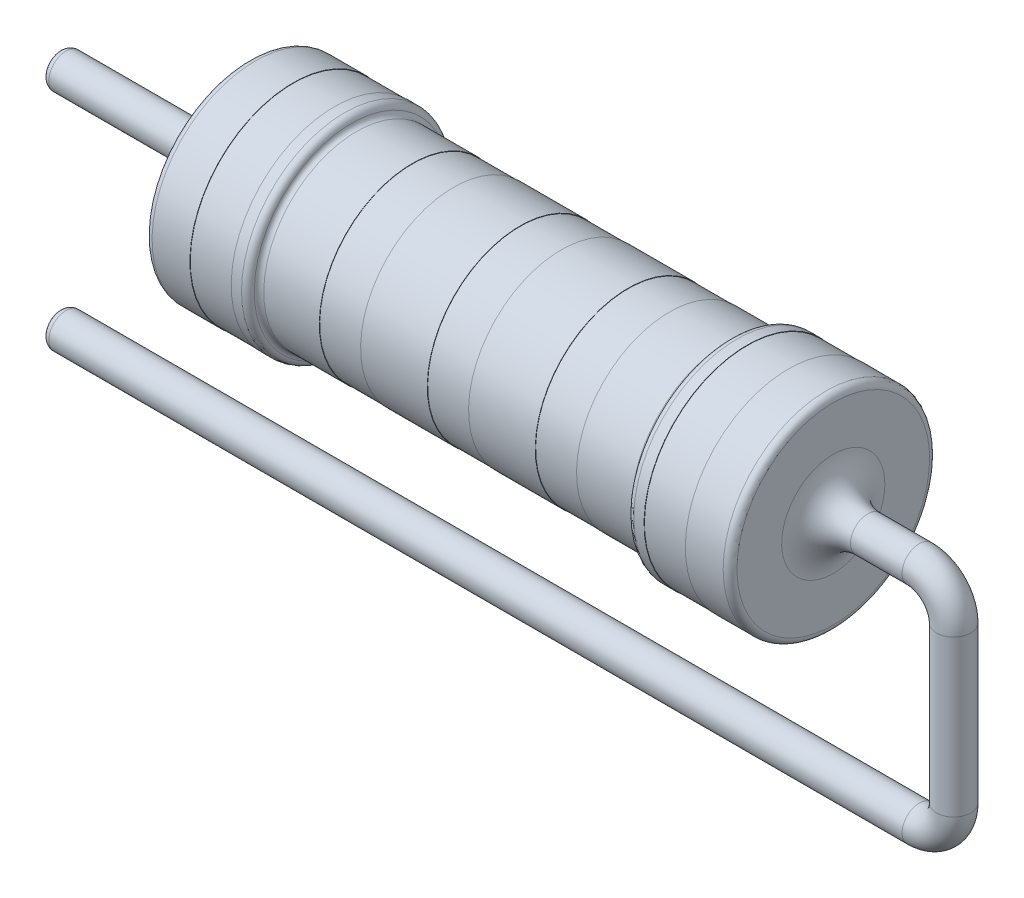
ISO-10303-21;
HEADER;
FILE_DESCRIPTION(('STEP AP214'),'2;1');
FILE_NAME('part.step','',(''),(''),'','','');
FILE_SCHEMA(('AUTOMOTIVE_DESIGN { 1 0 10303 214 1 1 1 1 }'));
ENDSEC;
DATA;
#1=APPLICATION_CONTEXT('core data for automotive mechanical design processes');
#2=APPLICATION_PROTOCOL_DEFINITION('international standard','automotive_design',2000,#1);
#3=PRODUCT_CONTEXT('',#1,'mechanical');
#4=PRODUCT('Part','Part','',(#3));
#5=PRODUCT_RELATED_PRODUCT_CATEGORY('part','',(#4));
#6=PRODUCT_DEFINITION_FORMATION('','',#4);
#7=PRODUCT_DEFINITION_CONTEXT('part definition',#1,'design');
#8=PRODUCT_DEFINITION('design','',#6,#7);
#9=PRODUCT_DEFINITION_SHAPE('','',#8);
#10=(LENGTH_UNIT() NAMED_UNIT(*) SI_UNIT(.MILLI.,.METRE.));
#11=(NAMED_UNIT(*) PLANE_ANGLE_UNIT() SI_UNIT($,.RADIAN.));
#12=(NAMED_UNIT(*) SI_UNIT($,.STERADIAN.) SOLID_ANGLE_UNIT());
#13=UNCERTAINTY_MEASURE_WITH_UNIT(LENGTH_MEASURE(1.E-05),#10,'distance_accuracy_value','');
#14=(GEOMETRIC_REPRESENTATION_CONTEXT(3) GLOBAL_UNCERTAINTY_ASSIGNED_CONTEXT((#13)) GLOBAL_UNIT_ASSIGNED_CONTEXT((#10,
#11,#12)) REPRESENTATION_CONTEXT('',''));
#15=CARTESIAN_POINT('',(0.,0.,0.));
#16=DIRECTION('',(0.,0.,1.));
#17=DIRECTION('',(1.,0.,0.));
#18=AXIS2_PLACEMENT_3D('',#15,#16,#17);
#19=CARTESIAN_POINT('',(8.5,0.,0.));
#20=DIRECTION('',(1.,0.,0.));
#21=DIRECTION('',(0.,1.,0.));
#22=AXIS2_PLACEMENT_3D('',#19,#20,#21);
#23=PLANE('',#22);
#24=CARTESIAN_POINT('',(8.5,0.,0.));
#25=DIRECTION('',(1.,0.,0.));
#26=DIRECTION('',(0.,1.,0.));
#27=AXIS2_PLACEMENT_3D('',#24,#25,#26);
#28=CIRCLE('',#27,1.5);
#29=CARTESIAN_POINT('',(8.5,1.5,0.));
#30=VERTEX_POINT('',#29);
#31=EDGE_CURVE('E45',#30,#30,#28,.F.);
#32=ORIENTED_EDGE('',*,*,#31,.T.);
#33=EDGE_LOOP('',(#32));
#34=FACE_BOUND('',#33,.T.);
#35=CARTESIAN_POINT('',(8.5,0.,0.));
#36=DIRECTION('',(1.,0.,0.));
#37=DIRECTION('',(0.,1.,0.));
#38=AXIS2_PLACEMENT_3D('',#35,#36,#37);
#39=CIRCLE('',#38,2.8);
#40=CARTESIAN_POINT('',(8.5,2.8,0.));
#41=VERTEX_POINT('',#40);
#42=EDGE_CURVE('E87',#41,#41,#39,.T.);
#43=ORIENTED_EDGE('',*,*,#42,.T.);
#44=EDGE_LOOP('',(#43));
#45=FACE_BOUND('',#44,.T.);
#46=ADVANCED_FACE('F34',(#34,#45),#23,.T.);
#47=CARTESIAN_POINT('',(-8.5,0.,0.));
#48=DIRECTION('',(-1.,0.,0.));
#49=DIRECTION('',(0.,-1.,0.));
#50=AXIS2_PLACEMENT_3D('',#47,#48,#49);
#51=CYLINDRICAL_SURFACE('',#50,3.);
#52=CARTESIAN_POINT('',(8.3,0.,0.));
#53=DIRECTION('',(1.,0.,0.));
#54=DIRECTION('',(0.,1.,0.));
#55=AXIS2_PLACEMENT_3D('',#52,#53,#54);
#56=CIRCLE('',#55,3.);
#57=CARTESIAN_POINT('',(8.3,3.,0.));
#58=VERTEX_POINT('',#57);
#59=EDGE_CURVE('E90',#58,#58,#56,.F.);
#60=ORIENTED_EDGE('',*,*,#59,.T.);
#61=EDGE_LOOP('',(#60));
#62=FACE_BOUND('',#61,.T.);
#63=CARTESIAN_POINT('',(7.2,0.,0.));
#64=DIRECTION('',(-1.,0.,0.));
#65=DIRECTION('',(0.,-1.,0.));
#66=AXIS2_PLACEMENT_3D('',#63,#64,#65);
#67=CIRCLE('',#66,3.);
#68=CARTESIAN_POINT('',(7.2,-3.,0.));
#69=VERTEX_POINT('',#68);
#70=EDGE_CURVE('E96',#69,#69,#67,.T.);
#71=ORIENTED_EDGE('',*,*,#70,.F.);
#72=EDGE_LOOP('',(#71));
#73=FACE_BOUND('',#72,.T.);
#74=ADVANCED_FACE('F187',(#62,#73),#51,.T.);
#75=CARTESIAN_POINT('',(7.2,-3.,0.));
#76=DIRECTION('',(-1.,0.,0.));
#77=DIRECTION('',(0.,-1.,0.));
#78=AXIS2_PLACEMENT_3D('',#75,#76,#77);
#79=PLANE('',#78);
#80=ORIENTED_EDGE('',*,*,#70,.T.);
#81=EDGE_LOOP('',(#80));
#82=FACE_BOUND('',#81,.T.);
#83=CARTESIAN_POINT('',(7.2,0.,0.));
#84=DIRECTION('',(-1.,0.,0.));
#85=DIRECTION('',(0.,-1.,0.));
#86=AXIS2_PLACEMENT_3D('',#83,#84,#85);
#87=CIRCLE('',#86,2.99);
#88=CARTESIAN_POINT('',(7.2,-2.99,0.));
#89=VERTEX_POINT('',#88);
#90=EDGE_CURVE('E99',#89,#89,#87,.T.);
#91=ORIENTED_EDGE('',*,*,#90,.F.);
#92=EDGE_LOOP('',(#91));
#93=FACE_BOUND('',#92,.T.);
#94=ADVANCED_FACE('F193',(#82,#93),#79,.T.);
#95=CARTESIAN_POINT('',(-8.5,0.,0.));
#96=DIRECTION('',(-1.,0.,0.));
#97=DIRECTION('',(0.,-1.,0.));
#98=AXIS2_PLACEMENT_3D('',#95,#96,#97);
#99=CYLINDRICAL_SURFACE('',#98,2.99);
#100=ORIENTED_EDGE('',*,*,#90,.T.);
#101=EDGE_LOOP('',(#100));
#102=FACE_BOUND('',#101,.T.);
#103=CARTESIAN_POINT('',(6.,0.,0.));
#104=DIRECTION('',(-1.,0.,0.));
#105=DIRECTION('',(0.,-1.,0.));
#106=AXIS2_PLACEMENT_3D('',#103,#104,#105);
#107=CIRCLE('',#106,2.99);
#108=CARTESIAN_POINT('',(6.,-2.99,0.));
#109=VERTEX_POINT('',#108);
#110=EDGE_CURVE('E102',#109,#109,#107,.T.);
#111=ORIENTED_EDGE('',*,*,#110,.F.);
#112=EDGE_LOOP('',(#111));
#113=FACE_BOUND('',#112,.T.);
#114=ADVANCED_FACE('F596',(#102,#113),#99,.T.);
#115=CARTESIAN_POINT('',(6.,-2.99,0.));
#116=DIRECTION('',(1.,0.,0.));
#117=DIRECTION('',(0.,1.,0.));
#118=AXIS2_PLACEMENT_3D('',#115,#116,#117);
#119=PLANE('',#118);
#120=ORIENTED_EDGE('',*,*,#110,.T.);
#121=EDGE_LOOP('',(#120));
#122=FACE_BOUND('',#121,.T.);
#123=CARTESIAN_POINT('',(6.,0.,0.));
#124=DIRECTION('',(-1.,0.,0.));
#125=DIRECTION('',(0.,-1.,0.));
#126=AXIS2_PLACEMENT_3D('',#123,#124,#125);
#127=CIRCLE('',#126,3.);
#128=CARTESIAN_POINT('',(6.,-3.,0.));
#129=VERTEX_POINT('',#128);
#130=EDGE_CURVE('E105',#129,#129,#127,.T.);
#131=ORIENTED_EDGE('',*,*,#130,.F.);
#132=EDGE_LOOP('',(#131));
#133=FACE_BOUND('',#132,.T.);
#134=ADVANCED_FACE('F446',(#122,#133),#119,.T.);
#135=CARTESIAN_POINT('',(-8.5,0.,0.));
#136=DIRECTION('',(-1.,0.,0.));
#137=DIRECTION('',(0.,-1.,0.));
#138=AXIS2_PLACEMENT_3D('',#135,#136,#137);
#139=CYLINDRICAL_SURFACE('',#138,3.);
#140=CARTESIAN_POINT('',(5.7,0.,0.));
#141=DIRECTION('',(-1.,0.,0.));
#142=DIRECTION('',(0.,-1.,0.));
#143=AXIS2_PLACEMENT_3D('',#140,#141,#142);
#144=CIRCLE('',#143,3.);
#145=CARTESIAN_POINT('',(5.7,-3.,0.));
#146=VERTEX_POINT('',#145);
#147=EDGE_CURVE('E93',#146,#146,#144,.F.);
#148=ORIENTED_EDGE('',*,*,#147,.T.);
#149=EDGE_LOOP('',(#148));
#150=FACE_BOUND('',#149,.T.);
#151=ORIENTED_EDGE('',*,*,#130,.T.);
#152=EDGE_LOOP('',(#151));
#153=FACE_BOUND('',#152,.T.);
#154=ADVANCED_FACE('F404',(#150,#153),#139,.T.);
#155=CARTESIAN_POINT('',(-8.5,0.,0.));
#156=DIRECTION('',(-1.,0.,0.));
#157=DIRECTION('',(0.,-1.,0.));
#158=AXIS2_PLACEMENT_3D('',#155,#156,#157);
#159=CYLINDRICAL_SURFACE('',#158,2.7);
#160=CARTESIAN_POINT('',(5.35358983848622,0.,0.));
#161=DIRECTION('',(-1.,0.,0.));
#162=DIRECTION('',(0.,-1.,0.));
#163=AXIS2_PLACEMENT_3D('',#160,#161,#162);
#164=CIRCLE('',#163,2.7);
#165=CARTESIAN_POINT('',(5.35358983848622,-2.7,0.));
#166=VERTEX_POINT('',#165);
#167=EDGE_CURVE('E69',#166,#166,#164,.T.);
#168=ORIENTED_EDGE('',*,*,#167,.T.);
#169=EDGE_LOOP('',(#168));
#170=FACE_BOUND('',#169,.T.);
#171=CARTESIAN_POINT('',(3.73802223615149,0.,0.));
#172=DIRECTION('',(-1.,0.,0.));
#173=DIRECTION('',(0.,-1.,0.));
#174=AXIS2_PLACEMENT_3D('',#171,#172,#173);
#175=CIRCLE('',#174,2.7);
#176=CARTESIAN_POINT('',(3.73802223615149,-2.7,0.));
#177=VERTEX_POINT('',#176);
#178=EDGE_CURVE('E108',#177,#177,#175,.T.);
#179=ORIENTED_EDGE('',*,*,#178,.F.);
#180=EDGE_LOOP('',(#179));
#181=FACE_BOUND('',#180,.T.);
#182=ADVANCED_FACE('F398',(#170,#181),#159,.T.);
#183=CARTESIAN_POINT('',(3.73802223615149,-2.7,0.));
#184=DIRECTION('',(-1.,0.,0.));
#185=DIRECTION('',(0.,-1.,0.));
#186=AXIS2_PLACEMENT_3D('',#183,#184,#185);
#187=PLANE('',#186);
#188=ORIENTED_EDGE('',*,*,#178,.T.);
#189=EDGE_LOOP('',(#188));
#190=FACE_BOUND('',#189,.T.);
#191=CARTESIAN_POINT('',(3.73802223615149,0.,0.));
#192=DIRECTION('',(-1.,0.,0.));
#193=DIRECTION('',(0.,-1.,0.));
#194=AXIS2_PLACEMENT_3D('',#191,#192,#193);
#195=CIRCLE('',#194,2.69);
#196=CARTESIAN_POINT('',(3.73802223615149,-2.69,0.));
#197=VERTEX_POINT('',#196);
#198=EDGE_CURVE('E111',#197,#197,#195,.T.);
#199=ORIENTED_EDGE('',*,*,#198,.F.);
#200=EDGE_LOOP('',(#199));
#201=FACE_BOUND('',#200,.T.);
#202=ADVANCED_FACE('F403',(#190,#201),#187,.T.);
#203=CARTESIAN_POINT('',(-8.5,0.,0.));
#204=DIRECTION('',(-1.,0.,0.));
#205=DIRECTION('',(0.,-1.,0.));
#206=AXIS2_PLACEMENT_3D('',#203,#204,#205);
#207=CYLINDRICAL_SURFACE('',#206,2.69);
#208=ORIENTED_EDGE('',*,*,#198,.T.);
#209=EDGE_LOOP('',(#208));
#210=FACE_BOUND('',#209,.T.);
#211=CARTESIAN_POINT('',(2.53802223615149,0.,0.));
#212=DIRECTION('',(-1.,0.,0.));
#213=DIRECTION('',(0.,-1.,0.));
#214=AXIS2_PLACEMENT_3D('',#211,#212,#213);
#215=CIRCLE('',#214,2.69);
#216=CARTESIAN_POINT('',(2.53802223615149,-2.69,0.));
#217=VERTEX_POINT('',#216);
#218=EDGE_CURVE('E114',#217,#217,#215,.T.);
#219=ORIENTED_EDGE('',*,*,#218,.F.);
#220=EDGE_LOOP('',(#219));
#221=FACE_BOUND('',#220,.T.);
#222=ADVANCED_FACE('F571',(#210,#221),#207,.T.);
#223=CARTESIAN_POINT('',(2.53802223615149,-2.69,0.));
#224=DIRECTION('',(1.,0.,0.));
#225=DIRECTION('',(0.,1.,0.));
#226=AXIS2_PLACEMENT_3D('',#223,#224,#225);
#227=PLANE('',#226);
#228=ORIENTED_EDGE('',*,*,#218,.T.);
#229=EDGE_LOOP('',(#228));
#230=FACE_BOUND('',#229,.T.);
#231=CARTESIAN_POINT('',(2.53802223615149,0.,0.));
#232=DIRECTION('',(-1.,0.,0.));
#233=DIRECTION('',(0.,-1.,0.));
#234=AXIS2_PLACEMENT_3D('',#231,#232,#233);
#235=CIRCLE('',#234,2.7);
#236=CARTESIAN_POINT('',(2.53802223615149,-2.7,0.));
#237=VERTEX_POINT('',#236);
#238=EDGE_CURVE('E117',#237,#237,#235,.T.);
#239=ORIENTED_EDGE('',*,*,#238,.F.);
#240=EDGE_LOOP('',(#239));
#241=FACE_BOUND('',#240,.T.);
#242=ADVANCED_FACE('F561',(#230,#241),#227,.T.);
#243=CARTESIAN_POINT('',(-8.5,0.,0.));
#244=DIRECTION('',(-1.,0.,0.));
#245=DIRECTION('',(0.,-1.,0.));
#246=AXIS2_PLACEMENT_3D('',#243,#244,#245);
#247=CYLINDRICAL_SURFACE('',#246,2.7);
#248=ORIENTED_EDGE('',*,*,#238,.T.);
#249=EDGE_LOOP('',(#248));
#250=FACE_BOUND('',#249,.T.);
#251=CARTESIAN_POINT('',(0.6,0.,0.));
#252=DIRECTION('',(-1.,0.,0.));
#253=DIRECTION('',(0.,-1.,0.));
#254=AXIS2_PLACEMENT_3D('',#251,#252,#253);
#255=CIRCLE('',#254,2.7);
#256=CARTESIAN_POINT('',(0.6,-2.7,0.));
#257=VERTEX_POINT('',#256);
#258=EDGE_CURVE('E120',#257,#257,#255,.T.);
#259=ORIENTED_EDGE('',*,*,#258,.F.);
#260=EDGE_LOOP('',(#259));
#261=FACE_BOUND('',#260,.T.);
#262=ADVANCED_FACE('F551',(#250,#261),#247,.T.);
#263=CARTESIAN_POINT('',(0.6,-2.7,0.));
#264=DIRECTION('',(-1.,0.,0.));
#265=DIRECTION('',(0.,-1.,0.));
#266=AXIS2_PLACEMENT_3D('',#263,#264,#265);
#267=PLANE('',#266);
#268=ORIENTED_EDGE('',*,*,#258,.T.);
#269=EDGE_LOOP('',(#268));
#270=FACE_BOUND('',#269,.T.);
#271=CARTESIAN_POINT('',(0.6,0.,0.));
#272=DIRECTION('',(-1.,0.,0.));
#273=DIRECTION('',(0.,-1.,0.));
#274=AXIS2_PLACEMENT_3D('',#271,#272,#273);
#275=CIRCLE('',#274,2.69);
#276=CARTESIAN_POINT('',(0.6,-2.69,0.));
#277=VERTEX_POINT('',#276);
#278=EDGE_CURVE('E123',#277,#277,#275,.T.);
#279=ORIENTED_EDGE('',*,*,#278,.F.);
#280=EDGE_LOOP('',(#279));
#281=FACE_BOUND('',#280,.T.);
#282=ADVANCED_FACE('F540',(#270,#281),#267,.T.);
#283=CARTESIAN_POINT('',(-8.5,0.,0.));
#284=DIRECTION('',(-1.,0.,0.));
#285=DIRECTION('',(0.,-1.,0.));
#286=AXIS2_PLACEMENT_3D('',#283,#284,#285);
#287=CYLINDRICAL_SURFACE('',#286,2.69);
#288=ORIENTED_EDGE('',*,*,#278,.T.);
#289=EDGE_LOOP('',(#288));
#290=FACE_BOUND('',#289,.T.);
#291=CARTESIAN_POINT('',(-0.6,0.,0.));
#292=DIRECTION('',(-1.,0.,0.));
#293=DIRECTION('',(0.,-1.,0.));
#294=AXIS2_PLACEMENT_3D('',#291,#292,#293);
#295=CIRCLE('',#294,2.69);
#296=CARTESIAN_POINT('',(-0.6,-2.69,0.));
#297=VERTEX_POINT('',#296);
#298=EDGE_CURVE('E126',#297,#297,#295,.T.);
#299=ORIENTED_EDGE('',*,*,#298,.F.);
#300=EDGE_LOOP('',(#299));
#301=FACE_BOUND('',#300,.T.);
#302=ADVANCED_FACE('F530',(#290,#301),#287,.T.);
#303=CARTESIAN_POINT('',(-0.6,-2.7,0.));
#304=DIRECTION('',(1.,0.,0.));
#305=DIRECTION('',(0.,1.,0.));
#306=AXIS2_PLACEMENT_3D('',#303,#304,#305);
#307=PLANE('',#306);
#308=ORIENTED_EDGE('',*,*,#298,.T.);
#309=EDGE_LOOP('',(#308));
#310=FACE_BOUND('',#309,.T.);
#311=CARTESIAN_POINT('',(-0.6,0.,0.));
#312=DIRECTION('',(-1.,0.,0.));
#313=DIRECTION('',(0.,-1.,0.));
#314=AXIS2_PLACEMENT_3D('',#311,#312,#313);
#315=CIRCLE('',#314,2.7);
#316=CARTESIAN_POINT('',(-0.6,-2.7,0.));
#317=VERTEX_POINT('',#316);
#318=EDGE_CURVE('E129',#317,#317,#315,.T.);
#319=ORIENTED_EDGE('',*,*,#318,.F.);
#320=EDGE_LOOP('',(#319));
#321=FACE_BOUND('',#320,.T.);
#322=ADVANCED_FACE('F520',(#310,#321),#307,.T.);
#323=CARTESIAN_POINT('',(-8.5,0.,0.));
#324=DIRECTION('',(-1.,0.,0.));
#325=DIRECTION('',(0.,-1.,0.));
#326=AXIS2_PLACEMENT_3D('',#323,#324,#325);
#327=CYLINDRICAL_SURFACE('',#326,2.7);
#328=ORIENTED_EDGE('',*,*,#318,.T.);
#329=EDGE_LOOP('',(#328));
#330=FACE_BOUND('',#329,.T.);
#331=CARTESIAN_POINT('',(-2.53802223615149,0.,0.));
#332=DIRECTION('',(-1.,0.,0.));
#333=DIRECTION('',(0.,-1.,0.));
#334=AXIS2_PLACEMENT_3D('',#331,#332,#333);
#335=CIRCLE('',#334,2.7);
#336=CARTESIAN_POINT('',(-2.53802223615149,-2.7,0.));
#337=VERTEX_POINT('',#336);
#338=EDGE_CURVE('E132',#337,#337,#335,.T.);
#339=ORIENTED_EDGE('',*,*,#338,.F.);
#340=EDGE_LOOP('',(#339));
#341=FACE_BOUND('',#340,.T.);
#342=ADVANCED_FACE('F510',(#330,#341),#327,.T.);
#343=CARTESIAN_POINT('',(-2.53802223615149,-2.69,0.));
#344=DIRECTION('',(-1.,0.,0.));
#345=DIRECTION('',(0.,-1.,0.));
#346=AXIS2_PLACEMENT_3D('',#343,#344,#345);
#347=PLANE('',#346);
#348=ORIENTED_EDGE('',*,*,#338,.T.);
#349=EDGE_LOOP('',(#348));
#350=FACE_BOUND('',#349,.T.);
#351=CARTESIAN_POINT('',(-2.53802223615149,0.,0.));
#352=DIRECTION('',(-1.,0.,0.));
#353=DIRECTION('',(0.,-1.,0.));
#354=AXIS2_PLACEMENT_3D('',#351,#352,#353);
#355=CIRCLE('',#354,2.69);
#356=CARTESIAN_POINT('',(-2.53802223615149,-2.69,0.));
#357=VERTEX_POINT('',#356);
#358=EDGE_CURVE('E135',#357,#357,#355,.T.);
#359=ORIENTED_EDGE('',*,*,#358,.F.);
#360=EDGE_LOOP('',(#359));
#361=FACE_BOUND('',#360,.T.);
#362=ADVANCED_FACE('F499',(#350,#361),#347,.T.);
#363=CARTESIAN_POINT('',(-8.5,0.,0.));
#364=DIRECTION('',(-1.,0.,0.));
#365=DIRECTION('',(0.,-1.,0.));
#366=AXIS2_PLACEMENT_3D('',#363,#364,#365);
#367=CYLINDRICAL_SURFACE('',#366,2.69);
#368=ORIENTED_EDGE('',*,*,#358,.T.);
#369=EDGE_LOOP('',(#368));
#370=FACE_BOUND('',#369,.T.);
#371=CARTESIAN_POINT('',(-3.73802223615149,0.,0.));
#372=DIRECTION('',(-1.,0.,0.));
#373=DIRECTION('',(0.,-1.,0.));
#374=AXIS2_PLACEMENT_3D('',#371,#372,#373);
#375=CIRCLE('',#374,2.69);
#376=CARTESIAN_POINT('',(-3.73802223615149,-2.69,0.));
#377=VERTEX_POINT('',#376);
#378=EDGE_CURVE('E138',#377,#377,#375,.T.);
#379=ORIENTED_EDGE('',*,*,#378,.F.);
#380=EDGE_LOOP('',(#379));
#381=FACE_BOUND('',#380,.T.);
#382=ADVANCED_FACE('F489',(#370,#381),#367,.T.);
#383=CARTESIAN_POINT('',(-3.73802223615149,-2.7,0.));
#384=DIRECTION('',(1.,0.,0.));
#385=DIRECTION('',(0.,1.,0.));
#386=AXIS2_PLACEMENT_3D('',#383,#384,#385);
#387=PLANE('',#386);
#388=ORIENTED_EDGE('',*,*,#378,.T.);
#389=EDGE_LOOP('',(#388));
#390=FACE_BOUND('',#389,.T.);
#391=CARTESIAN_POINT('',(-3.73802223615149,0.,0.));
#392=DIRECTION('',(-1.,0.,0.));
#393=DIRECTION('',(0.,-1.,0.));
#394=AXIS2_PLACEMENT_3D('',#391,#392,#393);
#395=CIRCLE('',#394,2.7);
#396=CARTESIAN_POINT('',(-3.73802223615149,-2.7,0.));
#397=VERTEX_POINT('',#396);
#398=EDGE_CURVE('E141',#397,#397,#395,.T.);
#399=ORIENTED_EDGE('',*,*,#398,.F.);
#400=EDGE_LOOP('',(#399));
#401=FACE_BOUND('',#400,.T.);
#402=ADVANCED_FACE('F388',(#390,#401),#387,.T.);
#403=CARTESIAN_POINT('',(-8.5,0.,0.));
#404=DIRECTION('',(-1.,0.,0.));
#405=DIRECTION('',(0.,-1.,0.));
#406=AXIS2_PLACEMENT_3D('',#403,#404,#405);
#407=CYLINDRICAL_SURFACE('',#406,2.7);
#408=CARTESIAN_POINT('',(-5.35358983848623,0.,0.));
#409=DIRECTION('',(-1.,0.,0.));
#410=DIRECTION('',(0.,-1.,0.));
#411=AXIS2_PLACEMENT_3D('',#408,#409,#410);
#412=CIRCLE('',#411,2.7);
#413=CARTESIAN_POINT('',(-5.35358983848623,-2.7,0.));
#414=VERTEX_POINT('',#413);
#415=EDGE_CURVE('E72',#414,#414,#412,.F.);
#416=ORIENTED_EDGE('',*,*,#415,.T.);
#417=EDGE_LOOP('',(#416));
#418=FACE_BOUND('',#417,.T.);
#419=ORIENTED_EDGE('',*,*,#398,.T.);
#420=EDGE_LOOP('',(#419));
#421=FACE_BOUND('',#420,.T.);
#422=ADVANCED_FACE('F382',(#418,#421),#407,.T.);
#423=CARTESIAN_POINT('',(-8.5,0.,0.));
#424=DIRECTION('',(-1.,0.,0.));
#425=DIRECTION('',(0.,-1.,0.));
#426=AXIS2_PLACEMENT_3D('',#423,#424,#425);
#427=CYLINDRICAL_SURFACE('',#426,3.);
#428=CARTESIAN_POINT('',(-5.7,0.,0.));
#429=DIRECTION('',(1.,0.,0.));
#430=DIRECTION('',(0.,1.,0.));
#431=AXIS2_PLACEMENT_3D('',#428,#429,#430);
#432=CIRCLE('',#431,3.);
#433=CARTESIAN_POINT('',(-5.7,3.,0.));
#434=VERTEX_POINT('',#433);
#435=EDGE_CURVE('E84',#434,#434,#432,.F.);
#436=ORIENTED_EDGE('',*,*,#435,.T.);
#437=EDGE_LOOP('',(#436));
#438=FACE_BOUND('',#437,.T.);
#439=CARTESIAN_POINT('',(-6.,0.,0.));
#440=DIRECTION('',(-1.,0.,0.));
#441=DIRECTION('',(0.,-1.,0.));
#442=AXIS2_PLACEMENT_3D('',#439,#440,#441);
#443=CIRCLE('',#442,3.);
#444=CARTESIAN_POINT('',(-6.,-3.,0.));
#445=VERTEX_POINT('',#444);
#446=EDGE_CURVE('E144',#445,#445,#443,.T.);
#447=ORIENTED_EDGE('',*,*,#446,.F.);
#448=EDGE_LOOP('',(#447));
#449=FACE_BOUND('',#448,.T.);
#450=ADVANCED_FACE('F387',(#438,#449),#427,.T.);
#451=CARTESIAN_POINT('',(-6.,-2.99,0.));
#452=DIRECTION('',(-1.,0.,0.));
#453=DIRECTION('',(0.,-1.,0.));
#454=AXIS2_PLACEMENT_3D('',#451,#452,#453);
#455=PLANE('',#454);
#456=ORIENTED_EDGE('',*,*,#446,.T.);
#457=EDGE_LOOP('',(#456));
#458=FACE_BOUND('',#457,.T.);
#459=CARTESIAN_POINT('',(-6.,0.,0.));
#460=DIRECTION('',(-1.,0.,0.));
#461=DIRECTION('',(0.,-1.,0.));
#462=AXIS2_PLACEMENT_3D('',#459,#460,#461);
#463=CIRCLE('',#462,2.99);
#464=CARTESIAN_POINT('',(-6.,-2.99,0.));
#465=VERTEX_POINT('',#464);
#466=EDGE_CURVE('E147',#465,#465,#463,.T.);
#467=ORIENTED_EDGE('',*,*,#466,.F.);
#468=EDGE_LOOP('',(#467));
#469=FACE_BOUND('',#468,.T.);
#470=ADVANCED_FACE('F436',(#458,#469),#455,.T.);
#471=CARTESIAN_POINT('',(-8.5,0.,0.));
#472=DIRECTION('',(-1.,0.,0.));
#473=DIRECTION('',(0.,-1.,0.));
#474=AXIS2_PLACEMENT_3D('',#471,#472,#473);
#475=CYLINDRICAL_SURFACE('',#474,2.99);
#476=ORIENTED_EDGE('',*,*,#466,.T.);
#477=EDGE_LOOP('',(#476));
#478=FACE_BOUND('',#477,.T.);
#479=CARTESIAN_POINT('',(-7.2,0.,0.));
#480=DIRECTION('',(-1.,0.,0.));
#481=DIRECTION('',(0.,-1.,0.));
#482=AXIS2_PLACEMENT_3D('',#479,#480,#481);
#483=CIRCLE('',#482,2.99);
#484=CARTESIAN_POINT('',(-7.2,-2.99,0.));
#485=VERTEX_POINT('',#484);
#486=EDGE_CURVE('E150',#485,#485,#483,.T.);
#487=ORIENTED_EDGE('',*,*,#486,.F.);
#488=EDGE_LOOP('',(#487));
#489=FACE_BOUND('',#488,.T.);
#490=ADVANCED_FACE('F463',(#478,#489),#475,.T.);
#491=CARTESIAN_POINT('',(-7.2,-3.,0.));
#492=DIRECTION('',(1.,0.,0.));
#493=DIRECTION('',(0.,1.,0.));
#494=AXIS2_PLACEMENT_3D('',#491,#492,#493);
#495=PLANE('',#494);
#496=ORIENTED_EDGE('',*,*,#486,.T.);
#497=EDGE_LOOP('',(#496));
#498=FACE_BOUND('',#497,.T.);
#499=CARTESIAN_POINT('',(-7.2,0.,0.));
#500=DIRECTION('',(-1.,0.,0.));
#501=DIRECTION('',(0.,-1.,0.));
#502=AXIS2_PLACEMENT_3D('',#499,#500,#501);
#503=CIRCLE('',#502,3.);
#504=CARTESIAN_POINT('',(-7.2,-3.,0.));
#505=VERTEX_POINT('',#504);
#506=EDGE_CURVE('E153',#505,#505,#503,.T.);
#507=ORIENTED_EDGE('',*,*,#506,.F.);
#508=EDGE_LOOP('',(#507));
#509=FACE_BOUND('',#508,.T.);
#510=ADVANCED_FACE('F426',(#498,#509),#495,.T.);
#511=CARTESIAN_POINT('',(-8.5,0.,0.));
#512=DIRECTION('',(-1.,0.,0.));
#513=DIRECTION('',(0.,-1.,0.));
#514=AXIS2_PLACEMENT_3D('',#511,#512,#513);
#515=CYLINDRICAL_SURFACE('',#514,3.);
#516=CARTESIAN_POINT('',(-8.3,0.,0.));
#517=DIRECTION('',(-1.,0.,0.));
#518=DIRECTION('',(0.,-1.,0.));
#519=AXIS2_PLACEMENT_3D('',#516,#517,#518);
#520=CIRCLE('',#519,3.);
#521=CARTESIAN_POINT('',(-8.3,-3.,0.));
#522=VERTEX_POINT('',#521);
#523=EDGE_CURVE('E78',#522,#522,#520,.F.);
#524=ORIENTED_EDGE('',*,*,#523,.T.);
#525=EDGE_LOOP('',(#524));
#526=FACE_BOUND('',#525,.T.);
#527=ORIENTED_EDGE('',*,*,#506,.T.);
#528=EDGE_LOOP('',(#527));
#529=FACE_BOUND('',#528,.T.);
#530=ADVANCED_FACE('F278',(#526,#529),#515,.T.);
#531=CARTESIAN_POINT('',(-8.5,0.,0.));
#532=DIRECTION('',(-1.,0.,0.));
#533=DIRECTION('',(0.,-1.,0.));
#534=AXIS2_PLACEMENT_3D('',#531,#532,#533);
#535=PLANE('',#534);
#536=CARTESIAN_POINT('',(-8.5,0.,0.));
#537=DIRECTION('',(-1.,0.,0.));
#538=DIRECTION('',(0.,-1.,0.));
#539=AXIS2_PLACEMENT_3D('',#536,#537,#538);
#540=CIRCLE('',#539,1.5);
#541=CARTESIAN_POINT('',(-8.5,-1.5,0.));
#542=VERTEX_POINT('',#541);
#543=EDGE_CURVE('E10',#542,#542,#540,.F.);
#544=ORIENTED_EDGE('',*,*,#543,.T.);
#545=EDGE_LOOP('',(#544));
#546=FACE_BOUND('',#545,.T.);
#547=CARTESIAN_POINT('',(-8.5,0.,0.));
#548=DIRECTION('',(-1.,0.,0.));
#549=DIRECTION('',(0.,-1.,0.));
#550=AXIS2_PLACEMENT_3D('',#547,#548,#549);
#551=CIRCLE('',#550,2.8);
#552=CARTESIAN_POINT('',(-8.5,-2.8,0.));
#553=VERTEX_POINT('',#552);
#554=EDGE_CURVE('E81',#553,#553,#551,.T.);
#555=ORIENTED_EDGE('',*,*,#554,.T.);
#556=EDGE_LOOP('',(#555));
#557=FACE_BOUND('',#556,.T.);
#558=ADVANCED_FACE('F203',(#546,#557),#535,.T.);
#559=CARTESIAN_POINT('',(5.7,0.,0.));
#560=DIRECTION('',(-1.,0.,0.));
#561=DIRECTION('',(0.,-1.,0.));
#562=AXIS2_PLACEMENT_3D('',#559,#560,#561);
#563=TOROIDAL_SURFACE('',#562,2.8,0.2);
#564=CARTESIAN_POINT('',(5.50205133627764,0.,0.));
#565=DIRECTION('',(1.,0.,0.));
#566=DIRECTION('',(0.,1.,0.));
#567=AXIS2_PLACEMENT_3D('',#564,#565,#566);
#568=CIRCLE('',#567,2.82857142857146);
#569=CARTESIAN_POINT('',(5.50205133627764,2.82857142857146,0.));
#570=VERTEX_POINT('',#569);
#571=EDGE_CURVE('E66',#570,#570,#568,.T.);
#572=ORIENTED_EDGE('',*,*,#571,.T.);
#573=EDGE_LOOP('',(#572));
#574=FACE_BOUND('',#573,.T.);
#575=ORIENTED_EDGE('',*,*,#147,.F.);
#576=EDGE_LOOP('',(#575));
#577=FACE_BOUND('',#576,.T.);
#578=ADVANCED_FACE('F199',(#574,#577),#563,.T.);
#579=CARTESIAN_POINT('',(8.3,0.,0.));
#580=DIRECTION('',(1.,0.,0.));
#581=DIRECTION('',(0.,1.,0.));
#582=AXIS2_PLACEMENT_3D('',#579,#580,#581);
#583=TOROIDAL_SURFACE('',#582,2.8,0.2);
#584=ORIENTED_EDGE('',*,*,#42,.F.);
#585=EDGE_LOOP('',(#584));
#586=FACE_BOUND('',#585,.T.);
#587=ORIENTED_EDGE('',*,*,#59,.F.);
#588=EDGE_LOOP('',(#587));
#589=FACE_BOUND('',#588,.T.);
#590=ADVANCED_FACE('F202',(#586,#589),#583,.T.);
#591=CARTESIAN_POINT('',(-5.7,0.,0.));
#592=DIRECTION('',(1.,0.,0.));
#593=DIRECTION('',(0.,1.,0.));
#594=AXIS2_PLACEMENT_3D('',#591,#592,#593);
#595=TOROIDAL_SURFACE('',#594,2.8,0.2);
#596=CARTESIAN_POINT('',(-5.50205133627827,0.,0.));
#597=DIRECTION('',(-1.,0.,0.));
#598=DIRECTION('',(0.,-1.,0.));
#599=AXIS2_PLACEMENT_3D('',#596,#597,#598);
#600=CIRCLE('',#599,2.82857142857137);
#601=CARTESIAN_POINT('',(-5.50205133627827,-2.82857142857137,0.));
#602=VERTEX_POINT('',#601);
#603=EDGE_CURVE('E75',#602,#602,#600,.T.);
#604=ORIENTED_EDGE('',*,*,#603,.T.);
#605=EDGE_LOOP('',(#604));
#606=FACE_BOUND('',#605,.T.);
#607=ORIENTED_EDGE('',*,*,#435,.F.);
#608=EDGE_LOOP('',(#607));
#609=FACE_BOUND('',#608,.T.);
#610=ADVANCED_FACE('F207',(#606,#609),#595,.T.);
#611=CARTESIAN_POINT('',(-8.3,0.,0.));
#612=DIRECTION('',(-1.,0.,0.));
#613=DIRECTION('',(0.,-1.,0.));
#614=AXIS2_PLACEMENT_3D('',#611,#612,#613);
#615=TOROIDAL_SURFACE('',#614,2.8,0.2);
#616=ORIENTED_EDGE('',*,*,#523,.F.);
#617=EDGE_LOOP('',(#616));
#618=FACE_BOUND('',#617,.T.);
#619=ORIENTED_EDGE('',*,*,#554,.F.);
#620=EDGE_LOOP('',(#619));
#621=FACE_BOUND('',#620,.T.);
#622=ADVANCED_FACE('F211',(#618,#621),#615,.T.);
#623=CARTESIAN_POINT('',(-5.35358983848623,0.,0.));
#624=DIRECTION('',(-1.,0.,0.));
#625=DIRECTION('',(0.,-1.,0.));
#626=AXIS2_PLACEMENT_3D('',#623,#624,#625);
#627=TOROIDAL_SURFACE('',#626,2.85,0.15);
#628=ORIENTED_EDGE('',*,*,#415,.F.);
#629=EDGE_LOOP('',(#628));
#630=FACE_BOUND('',#629,.T.);
#631=ORIENTED_EDGE('',*,*,#603,.F.);
#632=EDGE_LOOP('',(#631));
#633=FACE_BOUND('',#632,.T.);
#634=ADVANCED_FACE('F215',(#630,#633),#627,.F.);
#635=CARTESIAN_POINT('',(5.35358983848622,0.,0.));
#636=DIRECTION('',(-1.,0.,0.));
#637=DIRECTION('',(0.,-1.,0.));
#638=AXIS2_PLACEMENT_3D('',#635,#636,#637);
#639=TOROIDAL_SURFACE('',#638,2.85,0.15);
#640=ORIENTED_EDGE('',*,*,#571,.F.);
#641=EDGE_LOOP('',(#640));
#642=FACE_BOUND('',#641,.T.);
#643=ORIENTED_EDGE('',*,*,#167,.F.);
#644=EDGE_LOOP('',(#643));
#645=FACE_BOUND('',#644,.T.);
#646=ADVANCED_FACE('F219',(#642,#645),#639,.F.);
#647=CARTESIAN_POINT('',(11.,-6.53000244779705,0.));
#648=DIRECTION('',(-1.,0.,0.));
#649=DIRECTION('',(0.,0.,1.));
#650=AXIS2_PLACEMENT_3D('',#647,#648,#649);
#651=CYLINDRICAL_SURFACE('',#650,0.5);
#652=CARTESIAN_POINT('',(-13.8,-6.53000244779705,0.));
#653=DIRECTION('',(-1.,0.,0.));
#654=DIRECTION('',(0.,-1.,0.));
#655=AXIS2_PLACEMENT_3D('',#652,#653,#654);
#656=CIRCLE('',#655,0.5);
#657=CARTESIAN_POINT('',(-13.8,-7.03000244779705,0.));
#658=VERTEX_POINT('',#657);
#659=EDGE_CURVE('E60',#658,#658,#656,.F.);
#660=ORIENTED_EDGE('',*,*,#659,.T.);
#661=EDGE_LOOP('',(#660));
#662=FACE_BOUND('',#661,.T.);
#663=CARTESIAN_POINT('',(11.,-6.53000244779705,0.));
#664=DIRECTION('',(-1.,0.,0.));
#665=DIRECTION('',(0.,-1.,0.));
#666=AXIS2_PLACEMENT_3D('',#663,#664,#665);
#667=CIRCLE('',#666,0.5);
#668=CARTESIAN_POINT('',(11.,-7.03000244779705,0.));
#669=VERTEX_POINT('',#668);
#670=EDGE_CURVE('E156',#669,#669,#667,.T.);
#671=ORIENTED_EDGE('',*,*,#670,.T.);
#672=EDGE_LOOP('',(#671));
#673=FACE_BOUND('',#672,.T.);
#674=ADVANCED_FACE('F223',(#662,#673),#651,.T.);
#675=CARTESIAN_POINT('',(11.,-5.53000244779705,0.));
#676=DIRECTION('',(0.,0.,-1.));
#677=DIRECTION('',(-1.,0.,0.));
#678=AXIS2_PLACEMENT_3D('',#675,#676,#677);
#679=TOROIDAL_SURFACE('',#678,0.999999999999999,0.5);
#680=CARTESIAN_POINT('',(12.,-5.53000244779705,0.));
#681=DIRECTION('',(0.,-1.,0.));
#682=DIRECTION('',(1.,0.,0.));
#683=AXIS2_PLACEMENT_3D('',#680,#681,#682);
#684=CIRCLE('',#683,0.5);
#685=CARTESIAN_POINT('',(12.5,-5.53000244779705,0.));
#686=VERTEX_POINT('',#685);
#687=EDGE_CURVE('E159',#686,#686,#684,.T.);
#688=CARTESIAN_POINT('',(11.,-5.53000244779705,0.));
#689=DIRECTION('',(0.,0.,-1.));
#690=DIRECTION('',(-1.,0.,0.));
#691=AXIS2_PLACEMENT_3D('',#688,#689,#690);
#692=CIRCLE('',#691,1.5);
#693=EDGE_CURVE('',#686,#669,#692,.T.);
#694=ORIENTED_EDGE('',*,*,#687,.T.);
#695=ORIENTED_EDGE('',*,*,#670,.F.);
#696=ORIENTED_EDGE('',*,*,#693,.T.);
#697=ORIENTED_EDGE('',*,*,#693,.F.);
#698=EDGE_LOOP('',(#694,#696,#695,#697));
#699=FACE_BOUND('',#698,.T.);
#700=ADVANCED_FACE('F326',(#699),#679,.T.);
#701=CARTESIAN_POINT('',(12.,-0.999999999999999,0.));
#702=DIRECTION('',(0.,-1.,0.));
#703=DIRECTION('',(0.,0.,-1.));
#704=AXIS2_PLACEMENT_3D('',#701,#702,#703);
#705=CYLINDRICAL_SURFACE('',#704,0.5);
#706=CARTESIAN_POINT('',(12.,-0.999999999999999,0.));
#707=DIRECTION('',(0.,-1.,0.));
#708=DIRECTION('',(1.,0.,0.));
#709=AXIS2_PLACEMENT_3D('',#706,#707,#708);
#710=CIRCLE('',#709,0.5);
#711=CARTESIAN_POINT('',(12.5,-0.999999999999999,0.));
#712=VERTEX_POINT('',#711);
#713=EDGE_CURVE('E162',#712,#712,#710,.T.);
#714=ORIENTED_EDGE('',*,*,#713,.T.);
#715=EDGE_LOOP('',(#714));
#716=FACE_BOUND('',#715,.T.);
#717=ORIENTED_EDGE('',*,*,#687,.F.);
#718=EDGE_LOOP('',(#717));
#719=FACE_BOUND('',#718,.T.);
#720=ADVANCED_FACE('F184',(#716,#719),#705,.T.);
#721=CARTESIAN_POINT('',(11.,-1.,0.));
#722=DIRECTION('',(0.,0.,-1.));
#723=DIRECTION('',(-1.,0.,0.));
#724=AXIS2_PLACEMENT_3D('',#721,#722,#723);
#725=TOROIDAL_SURFACE('',#724,1.,0.5);
#726=CARTESIAN_POINT('',(11.,0.,0.));
#727=DIRECTION('',(1.,0.,0.));
#728=DIRECTION('',(0.,1.,0.));
#729=AXIS2_PLACEMENT_3D('',#726,#727,#728);
#730=CIRCLE('',#729,0.5);
#731=CARTESIAN_POINT('',(11.,0.5,0.));
#732=VERTEX_POINT('',#731);
#733=EDGE_CURVE('E165',#732,#732,#730,.T.);
#734=CARTESIAN_POINT('',(11.,-1.,0.));
#735=DIRECTION('',(0.,0.,-1.));
#736=DIRECTION('',(-1.,0.,0.));
#737=AXIS2_PLACEMENT_3D('',#734,#735,#736);
#738=CIRCLE('',#737,1.5);
#739=EDGE_CURVE('',#732,#712,#738,.T.);
#740=ORIENTED_EDGE('',*,*,#733,.T.);
#741=ORIENTED_EDGE('',*,*,#713,.F.);
#742=ORIENTED_EDGE('',*,*,#739,.T.);
#743=ORIENTED_EDGE('',*,*,#739,.F.);
#744=EDGE_LOOP('',(#740,#742,#741,#743));
#745=FACE_BOUND('',#744,.T.);
#746=ADVANCED_FACE('F169',(#745),#725,.T.);
#747=CARTESIAN_POINT('',(11.,0.,0.));
#748=DIRECTION('',(-1.,0.,0.));
#749=DIRECTION('',(0.,-1.,0.));
#750=AXIS2_PLACEMENT_3D('',#747,#748,#749);
#751=CYLINDRICAL_SURFACE('',#750,0.5);
#752=CARTESIAN_POINT('',(9.5,0.,0.));
#753=DIRECTION('',(1.,0.,0.));
#754=DIRECTION('',(0.,1.,0.));
#755=AXIS2_PLACEMENT_3D('',#752,#753,#754);
#756=CIRCLE('',#755,0.5);
#757=CARTESIAN_POINT('',(9.5,0.5,0.));
#758=VERTEX_POINT('',#757);
#759=EDGE_CURVE('E49',#758,#758,#756,.T.);
#760=ORIENTED_EDGE('',*,*,#759,.T.);
#761=EDGE_LOOP('',(#760));
#762=FACE_BOUND('',#761,.T.);
#763=ORIENTED_EDGE('',*,*,#733,.F.);
#764=EDGE_LOOP('',(#763));
#765=FACE_BOUND('',#764,.T.);
#766=ADVANCED_FACE('F172',(#762,#765),#751,.T.);
#767=CARTESIAN_POINT('',(-14.,-6.53000244779705,0.));
#768=DIRECTION('',(-1.,0.,0.));
#769=DIRECTION('',(0.,-1.,0.));
#770=AXIS2_PLACEMENT_3D('',#767,#768,#769);
#771=PLANE('',#770);
#772=CARTESIAN_POINT('',(-14.,-6.53000244779705,0.));
#773=DIRECTION('',(-1.,0.,0.));
#774=DIRECTION('',(0.,-1.,0.));
#775=AXIS2_PLACEMENT_3D('',#772,#773,#774);
#776=CIRCLE('',#775,0.3);
#777=CARTESIAN_POINT('',(-14.,-6.83000244779705,0.));
#778=VERTEX_POINT('',#777);
#779=EDGE_CURVE('E63',#778,#778,#776,.T.);
#780=ORIENTED_EDGE('',*,*,#779,.T.);
#781=EDGE_LOOP('',(#780));
#782=FACE_BOUND('',#781,.T.);
#783=ADVANCED_FACE('F174',(#782),#771,.T.);
#784=CARTESIAN_POINT('',(-14.,0.,0.));
#785=DIRECTION('',(1.,0.,0.));
#786=DIRECTION('',(0.,1.,0.));
#787=AXIS2_PLACEMENT_3D('',#784,#785,#786);
#788=CYLINDRICAL_SURFACE('',#787,0.5);
#789=CARTESIAN_POINT('',(-9.5,0.,0.));
#790=DIRECTION('',(-1.,0.,0.));
#791=DIRECTION('',(0.,-1.,0.));
#792=AXIS2_PLACEMENT_3D('',#789,#790,#791);
#793=CIRCLE('',#792,0.5);
#794=CARTESIAN_POINT('',(-9.5,-0.5,0.));
#795=VERTEX_POINT('',#794);
#796=EDGE_CURVE('E41',#795,#795,#793,.T.);
#797=ORIENTED_EDGE('',*,*,#796,.T.);
#798=EDGE_LOOP('',(#797));
#799=FACE_BOUND('',#798,.T.);
#800=CARTESIAN_POINT('',(-13.8,0.,0.));
#801=DIRECTION('',(-1.,0.,0.));
#802=DIRECTION('',(0.,-1.,0.));
#803=AXIS2_PLACEMENT_3D('',#800,#801,#802);
#804=CIRCLE('',#803,0.5);
#805=CARTESIAN_POINT('',(-13.8,-0.5,0.));
#806=VERTEX_POINT('',#805);
#807=EDGE_CURVE('E54',#806,#806,#804,.F.);
#808=ORIENTED_EDGE('',*,*,#807,.T.);
#809=EDGE_LOOP('',(#808));
#810=FACE_BOUND('',#809,.T.);
#811=ADVANCED_FACE('F181',(#799,#810),#788,.T.);
#812=CARTESIAN_POINT('',(-14.,0.,0.));
#813=DIRECTION('',(-1.,0.,0.));
#814=DIRECTION('',(0.,-1.,0.));
#815=AXIS2_PLACEMENT_3D('',#812,#813,#814);
#816=PLANE('',#815);
#817=CARTESIAN_POINT('',(-14.,0.,0.));
#818=DIRECTION('',(-1.,0.,0.));
#819=DIRECTION('',(0.,-1.,0.));
#820=AXIS2_PLACEMENT_3D('',#817,#818,#819);
#821=CIRCLE('',#820,0.3);
#822=CARTESIAN_POINT('',(-14.,-0.3,0.));
#823=VERTEX_POINT('',#822);
#824=EDGE_CURVE('E57',#823,#823,#821,.T.);
#825=ORIENTED_EDGE('',*,*,#824,.T.);
#826=EDGE_LOOP('',(#825));
#827=FACE_BOUND('',#826,.T.);
#828=ADVANCED_FACE('F229',(#827),#816,.T.);
#829=CARTESIAN_POINT('',(-13.8,-6.53000244779705,0.));
#830=DIRECTION('',(-1.,0.,0.));
#831=DIRECTION('',(0.,-1.,0.));
#832=AXIS2_PLACEMENT_3D('',#829,#830,#831);
#833=TOROIDAL_SURFACE('',#832,0.3,0.2);
#834=ORIENTED_EDGE('',*,*,#659,.F.);
#835=EDGE_LOOP('',(#834));
#836=FACE_BOUND('',#835,.T.);
#837=ORIENTED_EDGE('',*,*,#779,.F.);
#838=EDGE_LOOP('',(#837));
#839=FACE_BOUND('',#838,.T.);
#840=ADVANCED_FACE('F225',(#836,#839),#833,.T.);
#841=CARTESIAN_POINT('',(-13.8,0.,0.));
#842=DIRECTION('',(-1.,0.,0.));
#843=DIRECTION('',(0.,-1.,0.));
#844=AXIS2_PLACEMENT_3D('',#841,#842,#843);
#845=TOROIDAL_SURFACE('',#844,0.3,0.2);
#846=ORIENTED_EDGE('',*,*,#807,.F.);
#847=EDGE_LOOP('',(#846));
#848=FACE_BOUND('',#847,.T.);
#849=ORIENTED_EDGE('',*,*,#824,.F.);
#850=EDGE_LOOP('',(#849));
#851=FACE_BOUND('',#850,.T.);
#852=ADVANCED_FACE('F228',(#848,#851),#845,.T.);
#853=CARTESIAN_POINT('',(9.5,0.,0.));
#854=DIRECTION('',(1.,0.,0.));
#855=DIRECTION('',(0.,1.,0.));
#856=AXIS2_PLACEMENT_3D('',#853,#854,#855);
#857=TOROIDAL_SURFACE('',#856,1.5,1.);
#858=ORIENTED_EDGE('',*,*,#31,.F.);
#859=EDGE_LOOP('',(#858));
#860=FACE_BOUND('',#859,.T.);
#861=ORIENTED_EDGE('',*,*,#759,.F.);
#862=EDGE_LOOP('',(#861));
#863=FACE_BOUND('',#862,.T.);
#864=ADVANCED_FACE('F232',(#860,#863),#857,.F.);
#865=CARTESIAN_POINT('',(-9.5,0.,0.));
#866=DIRECTION('',(-1.,0.,0.));
#867=DIRECTION('',(0.,-1.,0.));
#868=AXIS2_PLACEMENT_3D('',#865,#866,#867);
#869=TOROIDAL_SURFACE('',#868,1.5,1.);
#870=ORIENTED_EDGE('',*,*,#543,.F.);
#871=EDGE_LOOP('',(#870));
#872=FACE_BOUND('',#871,.T.);
#873=ORIENTED_EDGE('',*,*,#796,.F.);
#874=EDGE_LOOP('',(#873));
#875=FACE_BOUND('',#874,.T.);
#876=ADVANCED_FACE('F36',(#872,#875),#869,.F.);
#877=CLOSED_SHELL('',(#46,#74,#94,#114,#134,#154,#182,#202,#222,#242,#262,#282,#302,#322,#342,
#362,#382,#402,#422,#450,#470,#490,#510,#530,#558,#578,#590,#610,#622,#634,#646,#674,#700,#720,
#746,#766,#783,#811,#828,#840,#852,#864,#876));
#878=MANIFOLD_SOLID_BREP('B2',#877);
#879=ADVANCED_BREP_SHAPE_REPRESENTATION('',(#18,#878),#14);
#880=SHAPE_DEFINITION_REPRESENTATION(#9,#879);
ENDSEC;
END-ISO-10303-21;
